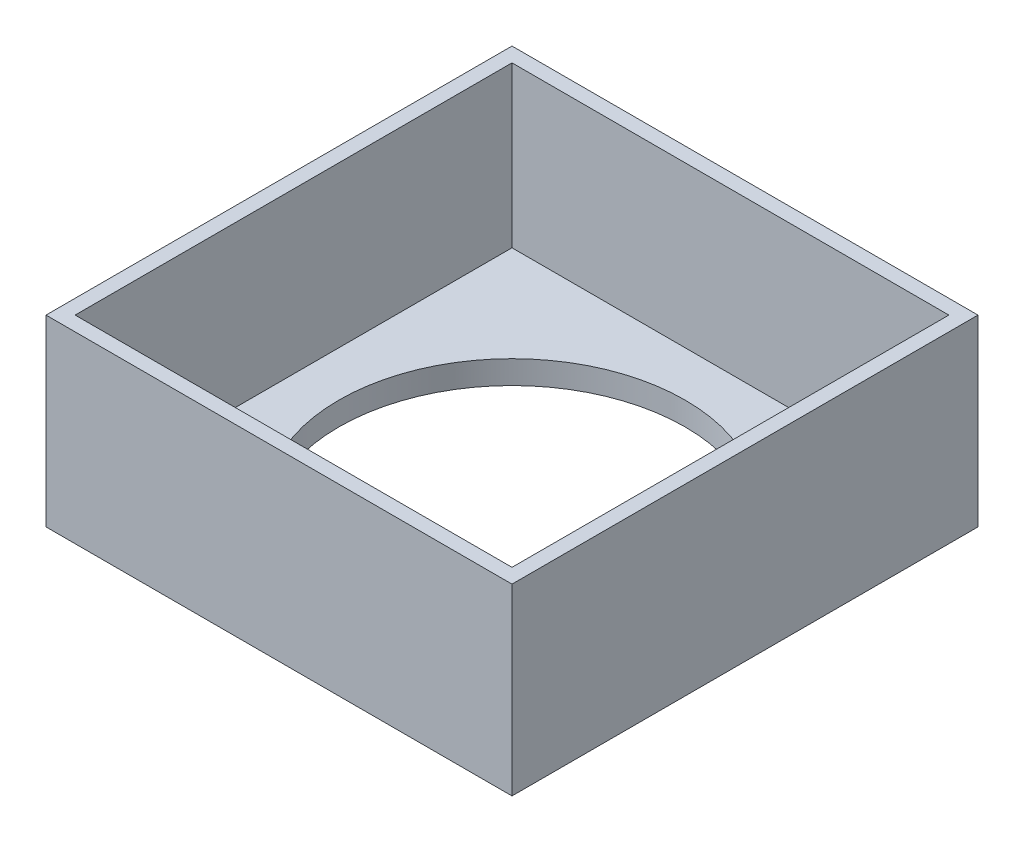
ISO-10303-21;
HEADER;
FILE_DESCRIPTION(('STEP AP214'),'2;1');
FILE_NAME('part.step','',(''),(''),'','','');
FILE_SCHEMA(('AUTOMOTIVE_DESIGN { 1 0 10303 214 1 1 1 1 }'));
ENDSEC;
DATA;
#1=APPLICATION_CONTEXT('core data for automotive mechanical design processes');
#2=APPLICATION_PROTOCOL_DEFINITION('international standard','automotive_design',2000,#1);
#3=PRODUCT_CONTEXT('',#1,'mechanical');
#4=PRODUCT('Part','Part','',(#3));
#5=PRODUCT_RELATED_PRODUCT_CATEGORY('part','',(#4));
#6=PRODUCT_DEFINITION_FORMATION('','',#4);
#7=PRODUCT_DEFINITION_CONTEXT('part definition',#1,'design');
#8=PRODUCT_DEFINITION('design','',#6,#7);
#9=PRODUCT_DEFINITION_SHAPE('','',#8);
#10=(LENGTH_UNIT() NAMED_UNIT(*) SI_UNIT(.MILLI.,.METRE.));
#11=(NAMED_UNIT(*) PLANE_ANGLE_UNIT() SI_UNIT($,.RADIAN.));
#12=(NAMED_UNIT(*) SI_UNIT($,.STERADIAN.) SOLID_ANGLE_UNIT());
#13=UNCERTAINTY_MEASURE_WITH_UNIT(LENGTH_MEASURE(1.E-05),#10,'distance_accuracy_value','');
#14=(GEOMETRIC_REPRESENTATION_CONTEXT(3) GLOBAL_UNCERTAINTY_ASSIGNED_CONTEXT((#13)) GLOBAL_UNIT_ASSIGNED_CONTEXT((#10,
#11,#12)) REPRESENTATION_CONTEXT('',''));
#15=CARTESIAN_POINT('',(0.,0.,0.));
#16=DIRECTION('',(0.,0.,1.));
#17=DIRECTION('',(1.,0.,0.));
#18=AXIS2_PLACEMENT_3D('',#15,#16,#17);
#19=CARTESIAN_POINT('',(-101.6,80.,-101.6));
#20=DIRECTION('',(1.,0.,0.));
#21=DIRECTION('',(0.,0.,-1.));
#22=AXIS2_PLACEMENT_3D('',#19,#20,#21);
#23=PLANE('',#22);
#24=DIRECTION('',(0.,0.,1.));
#25=VECTOR('',#24,1.);
#26=CARTESIAN_POINT('',(-101.6,0.,-101.6));
#27=LINE('',#26,#25);
#28=CARTESIAN_POINT('',(-101.6,0.,-101.6));
#29=VERTEX_POINT('',#28);
#30=CARTESIAN_POINT('',(-101.6,0.,101.6));
#31=VERTEX_POINT('',#30);
#32=EDGE_CURVE('E148',#29,#31,#27,.T.);
#33=ORIENTED_EDGE('',*,*,#32,.T.);
#34=DIRECTION('',(0.,-1.,0.));
#35=VECTOR('',#34,1.);
#36=CARTESIAN_POINT('',(-101.6,80.,101.6));
#37=LINE('',#36,#35);
#38=CARTESIAN_POINT('',(-101.6,80.,101.6));
#39=VERTEX_POINT('',#38);
#40=EDGE_CURVE('E11',#39,#31,#37,.T.);
#41=ORIENTED_EDGE('',*,*,#40,.F.);
#42=DIRECTION('',(0.,0.,1.));
#43=VECTOR('',#42,1.);
#44=CARTESIAN_POINT('',(-101.6,80.,-101.6));
#45=LINE('',#44,#43);
#46=CARTESIAN_POINT('',(-101.6,80.,-101.6));
#47=VERTEX_POINT('',#46);
#48=EDGE_CURVE('E149',#47,#39,#45,.T.);
#49=ORIENTED_EDGE('',*,*,#48,.F.);
#50=DIRECTION('',(0.,-1.,0.));
#51=VECTOR('',#50,1.);
#52=CARTESIAN_POINT('',(-101.6,80.,-101.6));
#53=LINE('',#52,#51);
#54=EDGE_CURVE('E155',#47,#29,#53,.T.);
#55=ORIENTED_EDGE('',*,*,#54,.T.);
#56=EDGE_LOOP('',(#33,#41,#49,#55));
#57=FACE_BOUND('',#56,.T.);
#58=ADVANCED_FACE('F32',(#57),#23,.F.);
#59=CARTESIAN_POINT('',(101.6,80.,101.6));
#60=DIRECTION('',(0.,0.,-1.));
#61=DIRECTION('',(-1.,0.,0.));
#62=AXIS2_PLACEMENT_3D('',#59,#60,#61);
#63=PLANE('',#62);
#64=DIRECTION('',(1.,0.,0.));
#65=VECTOR('',#64,1.);
#66=CARTESIAN_POINT('',(101.6,0.,101.6));
#67=LINE('',#66,#65);
#68=CARTESIAN_POINT('',(101.6,0.,101.6));
#69=VERTEX_POINT('',#68);
#70=EDGE_CURVE('E158',#31,#69,#67,.T.);
#71=ORIENTED_EDGE('',*,*,#70,.T.);
#72=DIRECTION('',(0.,-1.,0.));
#73=VECTOR('',#72,1.);
#74=CARTESIAN_POINT('',(101.6,80.,101.6));
#75=LINE('',#74,#73);
#76=CARTESIAN_POINT('',(101.6,80.,101.6));
#77=VERTEX_POINT('',#76);
#78=EDGE_CURVE('E40',#77,#69,#75,.T.);
#79=ORIENTED_EDGE('',*,*,#78,.F.);
#80=DIRECTION('',(1.,0.,0.));
#81=VECTOR('',#80,1.);
#82=CARTESIAN_POINT('',(101.6,80.,101.6));
#83=LINE('',#82,#81);
#84=EDGE_CURVE('E84',#39,#77,#83,.T.);
#85=ORIENTED_EDGE('',*,*,#84,.F.);
#86=ORIENTED_EDGE('',*,*,#40,.T.);
#87=EDGE_LOOP('',(#71,#79,#85,#86));
#88=FACE_BOUND('',#87,.T.);
#89=ADVANCED_FACE('F188',(#88),#63,.F.);
#90=CARTESIAN_POINT('',(101.6,80.,-101.6));
#91=DIRECTION('',(-1.,0.,0.));
#92=DIRECTION('',(0.,0.,1.));
#93=AXIS2_PLACEMENT_3D('',#90,#91,#92);
#94=PLANE('',#93);
#95=DIRECTION('',(0.,0.,-1.));
#96=VECTOR('',#95,1.);
#97=CARTESIAN_POINT('',(101.6,0.,-101.6));
#98=LINE('',#97,#96);
#99=CARTESIAN_POINT('',(101.6,0.,-101.6));
#100=VERTEX_POINT('',#99);
#101=EDGE_CURVE('E160',#69,#100,#98,.T.);
#102=ORIENTED_EDGE('',*,*,#101,.T.);
#103=DIRECTION('',(0.,-1.,0.));
#104=VECTOR('',#103,1.);
#105=CARTESIAN_POINT('',(101.6,80.,-101.6));
#106=LINE('',#105,#104);
#107=CARTESIAN_POINT('',(101.6,80.,-101.6));
#108=VERTEX_POINT('',#107);
#109=EDGE_CURVE('E164',#108,#100,#106,.T.);
#110=ORIENTED_EDGE('',*,*,#109,.F.);
#111=DIRECTION('',(0.,0.,-1.));
#112=VECTOR('',#111,1.);
#113=CARTESIAN_POINT('',(101.6,80.,-101.6));
#114=LINE('',#113,#112);
#115=EDGE_CURVE('E152',#77,#108,#114,.T.);
#116=ORIENTED_EDGE('',*,*,#115,.F.);
#117=ORIENTED_EDGE('',*,*,#78,.T.);
#118=EDGE_LOOP('',(#102,#110,#116,#117));
#119=FACE_BOUND('',#118,.T.);
#120=ADVANCED_FACE('F170',(#119),#94,.F.);
#121=CARTESIAN_POINT('',(101.6,80.,-101.6));
#122=DIRECTION('',(0.,0.,1.));
#123=DIRECTION('',(1.,0.,0.));
#124=AXIS2_PLACEMENT_3D('',#121,#122,#123);
#125=PLANE('',#124);
#126=DIRECTION('',(-1.,0.,0.));
#127=VECTOR('',#126,1.);
#128=CARTESIAN_POINT('',(101.6,0.,-101.6));
#129=LINE('',#128,#127);
#130=EDGE_CURVE('E77',#100,#29,#129,.T.);
#131=ORIENTED_EDGE('',*,*,#130,.T.);
#132=ORIENTED_EDGE('',*,*,#54,.F.);
#133=DIRECTION('',(-1.,0.,0.));
#134=VECTOR('',#133,1.);
#135=CARTESIAN_POINT('',(101.6,80.,-101.6));
#136=LINE('',#135,#134);
#137=EDGE_CURVE('E56',#108,#47,#136,.T.);
#138=ORIENTED_EDGE('',*,*,#137,.F.);
#139=ORIENTED_EDGE('',*,*,#109,.T.);
#140=EDGE_LOOP('',(#131,#132,#138,#139));
#141=FACE_BOUND('',#140,.T.);
#142=ADVANCED_FACE('F178',(#141),#125,.F.);
#143=CARTESIAN_POINT('',(0.,80.,0.));
#144=DIRECTION('',(0.,-1.,0.));
#145=DIRECTION('',(0.,0.,-1.));
#146=AXIS2_PLACEMENT_3D('',#143,#144,#145);
#147=PLANE('',#146);
#148=DIRECTION('',(1.,0.,0.));
#149=VECTOR('',#148,1.);
#150=CARTESIAN_POINT('',(95.2500000000001,80.,95.25));
#151=LINE('',#150,#149);
#152=CARTESIAN_POINT('',(-95.25,80.,95.25));
#153=VERTEX_POINT('',#152);
#154=CARTESIAN_POINT('',(95.2500000000001,80.,95.25));
#155=VERTEX_POINT('',#154);
#156=EDGE_CURVE('E136',#153,#155,#151,.T.);
#157=ORIENTED_EDGE('',*,*,#156,.F.);
#158=DIRECTION('',(0.,0.,1.));
#159=VECTOR('',#158,1.);
#160=CARTESIAN_POINT('',(-95.25,80.,-95.25));
#161=LINE('',#160,#159);
#162=CARTESIAN_POINT('',(-95.25,80.,-95.25));
#163=VERTEX_POINT('',#162);
#164=EDGE_CURVE('E47',#163,#153,#161,.T.);
#165=ORIENTED_EDGE('',*,*,#164,.F.);
#166=DIRECTION('',(-1.,0.,0.));
#167=VECTOR('',#166,1.);
#168=CARTESIAN_POINT('',(95.2500000000001,80.,-95.25));
#169=LINE('',#168,#167);
#170=CARTESIAN_POINT('',(95.2500000000001,80.,-95.25));
#171=VERTEX_POINT('',#170);
#172=EDGE_CURVE('E127',#171,#163,#169,.T.);
#173=ORIENTED_EDGE('',*,*,#172,.F.);
#174=DIRECTION('',(0.,0.,-1.));
#175=VECTOR('',#174,1.);
#176=CARTESIAN_POINT('',(95.2500000000001,80.,-95.25));
#177=LINE('',#176,#175);
#178=EDGE_CURVE('E130',#155,#171,#177,.T.);
#179=ORIENTED_EDGE('',*,*,#178,.F.);
#180=EDGE_LOOP('',(#157,#165,#173,#179));
#181=FACE_BOUND('',#180,.T.);
#182=ORIENTED_EDGE('',*,*,#48,.T.);
#183=ORIENTED_EDGE('',*,*,#84,.T.);
#184=ORIENTED_EDGE('',*,*,#115,.T.);
#185=ORIENTED_EDGE('',*,*,#137,.T.);
#186=EDGE_LOOP('',(#182,#183,#184,#185));
#187=FACE_BOUND('',#186,.T.);
#188=ADVANCED_FACE('F180',(#181,#187),#147,.F.);
#189=CARTESIAN_POINT('',(0.,0.,0.));
#190=DIRECTION('',(0.,-1.,0.));
#191=DIRECTION('',(0.,0.,-1.));
#192=AXIS2_PLACEMENT_3D('',#189,#190,#191);
#193=PLANE('',#192);
#194=CARTESIAN_POINT('',(0.,0.,0.));
#195=DIRECTION('',(0.,1.,0.));
#196=DIRECTION('',(0.,0.,1.));
#197=AXIS2_PLACEMENT_3D('',#194,#195,#196);
#198=CIRCLE('',#197,75.5);
#199=CARTESIAN_POINT('',(0.,0.,75.5));
#200=VERTEX_POINT('',#199);
#201=EDGE_CURVE('E145',#200,#200,#198,.T.);
#202=ORIENTED_EDGE('',*,*,#201,.T.);
#203=EDGE_LOOP('',(#202));
#204=FACE_BOUND('',#203,.T.);
#205=ORIENTED_EDGE('',*,*,#32,.F.);
#206=ORIENTED_EDGE('',*,*,#130,.F.);
#207=ORIENTED_EDGE('',*,*,#101,.F.);
#208=ORIENTED_EDGE('',*,*,#70,.F.);
#209=EDGE_LOOP('',(#205,#206,#207,#208));
#210=FACE_BOUND('',#209,.T.);
#211=ADVANCED_FACE('F174',(#204,#210),#193,.T.);
#212=CARTESIAN_POINT('',(0.,0.,0.));
#213=DIRECTION('',(0.,1.,0.));
#214=DIRECTION('',(0.,0.,1.));
#215=AXIS2_PLACEMENT_3D('',#212,#213,#214);
#216=CYLINDRICAL_SURFACE('',#215,75.5);
#217=CARTESIAN_POINT('',(0.,10.15,0.));
#218=DIRECTION('',(0.,-1.,0.));
#219=DIRECTION('',(0.,0.,-1.));
#220=AXIS2_PLACEMENT_3D('',#217,#218,#219);
#221=CIRCLE('',#220,75.5);
#222=CARTESIAN_POINT('',(0.,10.15,-75.5));
#223=VERTEX_POINT('',#222);
#224=EDGE_CURVE('E35',#223,#223,#221,.F.);
#225=ORIENTED_EDGE('',*,*,#224,.T.);
#226=EDGE_LOOP('',(#225));
#227=FACE_BOUND('',#226,.T.);
#228=ORIENTED_EDGE('',*,*,#201,.F.);
#229=EDGE_LOOP('',(#228));
#230=FACE_BOUND('',#229,.T.);
#231=ADVANCED_FACE('F215',(#227,#230),#216,.F.);
#232=CARTESIAN_POINT('',(0.,10.15,0.));
#233=DIRECTION('',(0.,-1.,0.));
#234=DIRECTION('',(0.,0.,-1.));
#235=AXIS2_PLACEMENT_3D('',#232,#233,#234);
#236=PLANE('',#235);
#237=DIRECTION('',(0.,0.,1.));
#238=VECTOR('',#237,1.);
#239=CARTESIAN_POINT('',(-95.25,10.15,-95.25));
#240=LINE('',#239,#238);
#241=CARTESIAN_POINT('',(-95.25,10.15,-95.25));
#242=VERTEX_POINT('',#241);
#243=CARTESIAN_POINT('',(-95.25,10.15,95.25));
#244=VERTEX_POINT('',#243);
#245=EDGE_CURVE('E108',#242,#244,#240,.T.);
#246=ORIENTED_EDGE('',*,*,#245,.T.);
#247=DIRECTION('',(1.,0.,0.));
#248=VECTOR('',#247,1.);
#249=CARTESIAN_POINT('',(95.2500000000001,10.15,95.25));
#250=LINE('',#249,#248);
#251=CARTESIAN_POINT('',(95.2500000000001,10.15,95.25));
#252=VERTEX_POINT('',#251);
#253=EDGE_CURVE('E117',#244,#252,#250,.T.);
#254=ORIENTED_EDGE('',*,*,#253,.T.);
#255=DIRECTION('',(0.,0.,-1.));
#256=VECTOR('',#255,1.);
#257=CARTESIAN_POINT('',(95.2500000000001,10.15,-95.25));
#258=LINE('',#257,#256);
#259=CARTESIAN_POINT('',(95.2500000000001,10.15,-95.25));
#260=VERTEX_POINT('',#259);
#261=EDGE_CURVE('E122',#252,#260,#258,.T.);
#262=ORIENTED_EDGE('',*,*,#261,.T.);
#263=DIRECTION('',(-1.,0.,0.));
#264=VECTOR('',#263,1.);
#265=CARTESIAN_POINT('',(95.2500000000001,10.15,-95.25));
#266=LINE('',#265,#264);
#267=EDGE_CURVE('E114',#260,#242,#266,.T.);
#268=ORIENTED_EDGE('',*,*,#267,.T.);
#269=EDGE_LOOP('',(#246,#254,#262,#268));
#270=FACE_BOUND('',#269,.T.);
#271=ORIENTED_EDGE('',*,*,#224,.F.);
#272=EDGE_LOOP('',(#271));
#273=FACE_BOUND('',#272,.T.);
#274=ADVANCED_FACE('F124',(#270,#273),#236,.F.);
#275=CARTESIAN_POINT('',(-95.25,10.15,-95.25));
#276=DIRECTION('',(-1.,0.,0.));
#277=DIRECTION('',(0.,0.,1.));
#278=AXIS2_PLACEMENT_3D('',#275,#276,#277);
#279=PLANE('',#278);
#280=ORIENTED_EDGE('',*,*,#164,.T.);
#281=DIRECTION('',(0.,1.,0.));
#282=VECTOR('',#281,1.);
#283=CARTESIAN_POINT('',(-95.25,10.15,95.25));
#284=LINE('',#283,#282);
#285=EDGE_CURVE('E104',#244,#153,#284,.T.);
#286=ORIENTED_EDGE('',*,*,#285,.F.);
#287=ORIENTED_EDGE('',*,*,#245,.F.);
#288=DIRECTION('',(0.,1.,0.));
#289=VECTOR('',#288,1.);
#290=CARTESIAN_POINT('',(-95.25,10.15,-95.25));
#291=LINE('',#290,#289);
#292=EDGE_CURVE('E140',#242,#163,#291,.T.);
#293=ORIENTED_EDGE('',*,*,#292,.T.);
#294=EDGE_LOOP('',(#280,#286,#287,#293));
#295=FACE_BOUND('',#294,.T.);
#296=ADVANCED_FACE('F106',(#295),#279,.F.);
#297=CARTESIAN_POINT('',(95.2500000000001,10.15,-95.25));
#298=DIRECTION('',(0.,0.,-1.));
#299=DIRECTION('',(-1.,0.,0.));
#300=AXIS2_PLACEMENT_3D('',#297,#298,#299);
#301=PLANE('',#300);
#302=ORIENTED_EDGE('',*,*,#172,.T.);
#303=ORIENTED_EDGE('',*,*,#292,.F.);
#304=ORIENTED_EDGE('',*,*,#267,.F.);
#305=DIRECTION('',(0.,1.,0.));
#306=VECTOR('',#305,1.);
#307=CARTESIAN_POINT('',(95.2500000000001,10.15,-95.25));
#308=LINE('',#307,#306);
#309=EDGE_CURVE('E142',#260,#171,#308,.T.);
#310=ORIENTED_EDGE('',*,*,#309,.T.);
#311=EDGE_LOOP('',(#302,#303,#304,#310));
#312=FACE_BOUND('',#311,.T.);
#313=ADVANCED_FACE('F246',(#312),#301,.F.);
#314=CARTESIAN_POINT('',(95.2500000000001,10.15,-95.25));
#315=DIRECTION('',(1.,0.,0.));
#316=DIRECTION('',(0.,0.,-1.));
#317=AXIS2_PLACEMENT_3D('',#314,#315,#316);
#318=PLANE('',#317);
#319=ORIENTED_EDGE('',*,*,#178,.T.);
#320=ORIENTED_EDGE('',*,*,#309,.F.);
#321=ORIENTED_EDGE('',*,*,#261,.F.);
#322=DIRECTION('',(0.,1.,0.));
#323=VECTOR('',#322,1.);
#324=CARTESIAN_POINT('',(95.2500000000001,10.15,95.25));
#325=LINE('',#324,#323);
#326=EDGE_CURVE('E113',#252,#155,#325,.T.);
#327=ORIENTED_EDGE('',*,*,#326,.T.);
#328=EDGE_LOOP('',(#319,#320,#321,#327));
#329=FACE_BOUND('',#328,.T.);
#330=ADVANCED_FACE('F255',(#329),#318,.F.);
#331=CARTESIAN_POINT('',(95.2500000000001,10.15,95.25));
#332=DIRECTION('',(0.,0.,1.));
#333=DIRECTION('',(1.,0.,0.));
#334=AXIS2_PLACEMENT_3D('',#331,#332,#333);
#335=PLANE('',#334);
#336=ORIENTED_EDGE('',*,*,#156,.T.);
#337=ORIENTED_EDGE('',*,*,#326,.F.);
#338=ORIENTED_EDGE('',*,*,#253,.F.);
#339=ORIENTED_EDGE('',*,*,#285,.T.);
#340=EDGE_LOOP('',(#336,#337,#338,#339));
#341=FACE_BOUND('',#340,.T.);
#342=ADVANCED_FACE('F118',(#341),#335,.F.);
#343=CLOSED_SHELL('',(#58,#89,#120,#142,#188,#211,#231,#274,#296,#313,#330,#342));
#344=MANIFOLD_SOLID_BREP('B2',#343);
#345=ADVANCED_BREP_SHAPE_REPRESENTATION('',(#18,#344),#14);
#346=SHAPE_DEFINITION_REPRESENTATION(#9,#345);
ENDSEC;
END-ISO-10303-21;
